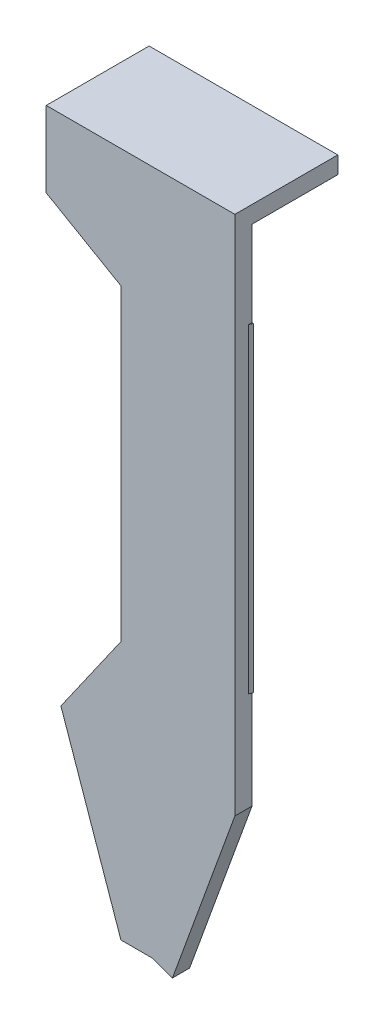
ISO-10303-21;
HEADER;
FILE_DESCRIPTION(('STEP AP214'),'2;1');
FILE_NAME('part.step','',(''),(''),'','','');
FILE_SCHEMA(('AUTOMOTIVE_DESIGN { 1 0 10303 214 1 1 1 1 }'));
ENDSEC;
DATA;
#1=APPLICATION_CONTEXT('core data for automotive mechanical design processes');
#2=APPLICATION_PROTOCOL_DEFINITION('international standard','automotive_design',2000,#1);
#3=PRODUCT_CONTEXT('',#1,'mechanical');
#4=PRODUCT('Part','Part','',(#3));
#5=PRODUCT_RELATED_PRODUCT_CATEGORY('part','',(#4));
#6=PRODUCT_DEFINITION_FORMATION('','',#4);
#7=PRODUCT_DEFINITION_CONTEXT('part definition',#1,'design');
#8=PRODUCT_DEFINITION('design','',#6,#7);
#9=PRODUCT_DEFINITION_SHAPE('','',#8);
#10=(LENGTH_UNIT() NAMED_UNIT(*) SI_UNIT(.MILLI.,.METRE.));
#11=(NAMED_UNIT(*) PLANE_ANGLE_UNIT() SI_UNIT($,.RADIAN.));
#12=(NAMED_UNIT(*) SI_UNIT($,.STERADIAN.) SOLID_ANGLE_UNIT());
#13=UNCERTAINTY_MEASURE_WITH_UNIT(LENGTH_MEASURE(1.E-05),#10,'distance_accuracy_value','');
#14=(GEOMETRIC_REPRESENTATION_CONTEXT(3) GLOBAL_UNCERTAINTY_ASSIGNED_CONTEXT((#13)) GLOBAL_UNIT_ASSIGNED_CONTEXT((#10,
#11,#12)) REPRESENTATION_CONTEXT('',''));
#15=CARTESIAN_POINT('',(0.,0.,0.));
#16=DIRECTION('',(0.,0.,1.));
#17=DIRECTION('',(1.,0.,0.));
#18=AXIS2_PLACEMENT_3D('',#15,#16,#17);
#19=CARTESIAN_POINT('',(73.289553246,-32.363508327,11.5));
#20=DIRECTION('',(0.,0.,1.));
#21=DIRECTION('',(1.,0.,0.));
#22=AXIS2_PLACEMENT_3D('',#19,#20,#21);
#23=PLANE('',#22);
#24=DIRECTION('',(-1.,0.,0.));
#25=VECTOR('',#24,1.);
#26=CARTESIAN_POINT('',(84.289553246,-32.363508327,11.5));
#27=LINE('',#26,#25);
#28=CARTESIAN_POINT('',(95.289553246,-32.3635083309895,11.5));
#29=VERTEX_POINT('',#28);
#30=CARTESIAN_POINT('',(73.289553246,-32.363508327,11.5));
#31=VERTEX_POINT('',#30);
#32=EDGE_CURVE('E154',#29,#31,#27,.T.);
#33=ORIENTED_EDGE('',*,*,#32,.T.);
#34=DIRECTION('',(0.,1.,0.));
#35=VECTOR('',#34,1.);
#36=CARTESIAN_POINT('',(73.289553246,-34.2040161205,11.5));
#37=LINE('',#36,#35);
#38=CARTESIAN_POINT('',(73.289553246,-30.363508327,11.5));
#39=VERTEX_POINT('',#38);
#40=EDGE_CURVE('E148',#31,#39,#37,.T.);
#41=ORIENTED_EDGE('',*,*,#40,.T.);
#42=DIRECTION('',(-1.,0.,0.));
#43=VECTOR('',#42,1.);
#44=CARTESIAN_POINT('',(84.289553246,-30.363508327,11.5));
#45=LINE('',#44,#43);
#46=CARTESIAN_POINT('',(95.289553246,-30.363508327,11.5));
#47=VERTEX_POINT('',#46);
#48=EDGE_CURVE('E446',#47,#39,#45,.T.);
#49=ORIENTED_EDGE('',*,*,#48,.F.);
#50=DIRECTION('',(0.,-1.,0.));
#51=VECTOR('',#50,1.);
#52=CARTESIAN_POINT('',(95.289553246,-60.748418779,11.5));
#53=LINE('',#52,#51);
#54=EDGE_CURVE('E603',#47,#29,#53,.T.);
#55=ORIENTED_EDGE('',*,*,#54,.T.);
#56=EDGE_LOOP('',(#33,#41,#49,#55));
#57=FACE_BOUND('',#56,.T.);
#58=ADVANCED_FACE('F19',(#57),#23,.F.);
#59=CARTESIAN_POINT('',(73.289553246,-30.363508327,11.5));
#60=DIRECTION('',(0.,1.,0.));
#61=DIRECTION('',(0.,0.,1.));
#62=AXIS2_PLACEMENT_3D('',#59,#60,#61);
#63=PLANE('',#62);
#64=DIRECTION('',(0.,0.,-1.));
#65=VECTOR('',#64,1.);
#66=CARTESIAN_POINT('',(95.289553246,-30.363508327,17.5));
#67=LINE('',#66,#65);
#68=CARTESIAN_POINT('',(95.289553246,-30.363508327,23.5));
#69=VERTEX_POINT('',#68);
#70=EDGE_CURVE('E250',#69,#47,#67,.T.);
#71=ORIENTED_EDGE('',*,*,#70,.T.);
#72=ORIENTED_EDGE('',*,*,#48,.T.);
#73=DIRECTION('',(0.,0.,1.));
#74=VECTOR('',#73,1.);
#75=CARTESIAN_POINT('',(73.289553246,-30.363508327,17.5));
#76=LINE('',#75,#74);
#77=CARTESIAN_POINT('',(73.289553246,-30.363508327,23.5));
#78=VERTEX_POINT('',#77);
#79=EDGE_CURVE('E177',#39,#78,#76,.T.);
#80=ORIENTED_EDGE('',*,*,#79,.T.);
#81=DIRECTION('',(1.,0.,0.));
#82=VECTOR('',#81,1.);
#83=CARTESIAN_POINT('',(84.289553246,-30.363508327,23.5));
#84=LINE('',#83,#82);
#85=EDGE_CURVE('E153',#78,#69,#84,.T.);
#86=ORIENTED_EDGE('',*,*,#85,.T.);
#87=EDGE_LOOP('',(#71,#72,#80,#86));
#88=FACE_BOUND('',#87,.T.);
#89=ADVANCED_FACE('F668',(#88),#63,.T.);
#90=CARTESIAN_POINT('',(73.289553246,-38.044523914,23.5));
#91=DIRECTION('',(1.,0.,0.));
#92=DIRECTION('',(0.,0.,-1.));
#93=AXIS2_PLACEMENT_3D('',#90,#91,#92);
#94=PLANE('',#93);
#95=ORIENTED_EDGE('',*,*,#40,.F.);
#96=DIRECTION('',(0.,0.,1.));
#97=VECTOR('',#96,1.);
#98=CARTESIAN_POINT('',(73.289553246,-32.363508327,16.5));
#99=LINE('',#98,#97);
#100=CARTESIAN_POINT('',(73.289553246,-32.363508327,21.5));
#101=VERTEX_POINT('',#100);
#102=EDGE_CURVE('E144',#31,#101,#99,.T.);
#103=ORIENTED_EDGE('',*,*,#102,.T.);
#104=DIRECTION('',(0.,-1.,0.));
#105=VECTOR('',#104,1.);
#106=CARTESIAN_POINT('',(73.289553246,-71.984728242,21.5));
#107=LINE('',#106,#105);
#108=CARTESIAN_POINT('',(73.289553246,-39.1992244517813,21.5));
#109=VERTEX_POINT('',#108);
#110=EDGE_CURVE('E129',#101,#109,#107,.T.);
#111=ORIENTED_EDGE('',*,*,#110,.T.);
#112=DIRECTION('',(0.,0.,1.));
#113=VECTOR('',#112,1.);
#114=CARTESIAN_POINT('',(73.289553246,-39.1992244517813,23.5));
#115=LINE('',#114,#113);
#116=CARTESIAN_POINT('',(73.289553246,-39.1992244517813,23.5));
#117=VERTEX_POINT('',#116);
#118=EDGE_CURVE('E160',#117,#109,#115,.F.);
#119=ORIENTED_EDGE('',*,*,#118,.F.);
#120=DIRECTION('',(0.,1.,0.));
#121=VECTOR('',#120,1.);
#122=CARTESIAN_POINT('',(73.289553246,-70.990728242,23.5));
#123=LINE('',#122,#121);
#124=EDGE_CURVE('E141',#117,#78,#123,.T.);
#125=ORIENTED_EDGE('',*,*,#124,.T.);
#126=ORIENTED_EDGE('',*,*,#79,.F.);
#127=EDGE_LOOP('',(#95,#103,#111,#119,#125,#126));
#128=FACE_BOUND('',#127,.T.);
#129=ADVANCED_FACE('F145',(#128),#94,.F.);
#130=CARTESIAN_POINT('',(74.289553246,-39.776574721,23.5));
#131=DIRECTION('',(0.500000000018918,0.866025403773516,0.));
#132=DIRECTION('',(0.866025403773516,-0.500000000018918,0.));
#133=AXIS2_PLACEMENT_3D('',#130,#131,#132);
#134=PLANE('',#133);
#135=DIRECTION('',(0.866025403773516,-0.500000000018918,0.));
#136=VECTOR('',#135,1.);
#137=CARTESIAN_POINT('',(74.289553246,-39.776574721,23.5));
#138=LINE('',#137,#136);
#139=CARTESIAN_POINT('',(82.,-44.2282032302188,23.5));
#140=VERTEX_POINT('',#139);
#141=EDGE_CURVE('E522',#140,#117,#138,.F.);
#142=ORIENTED_EDGE('',*,*,#141,.T.);
#143=ORIENTED_EDGE('',*,*,#118,.T.);
#144=DIRECTION('',(0.866025403773516,-0.500000000018918,0.));
#145=VECTOR('',#144,1.);
#146=CARTESIAN_POINT('',(74.289553246,-39.776574721,21.5));
#147=LINE('',#146,#145);
#148=CARTESIAN_POINT('',(82.,-44.2282032302188,21.5));
#149=VERTEX_POINT('',#148);
#150=EDGE_CURVE('E136',#109,#149,#147,.T.);
#151=ORIENTED_EDGE('',*,*,#150,.T.);
#152=DIRECTION('',(0.,0.,-1.));
#153=VECTOR('',#152,1.);
#154=CARTESIAN_POINT('',(82.,-44.2282032302188,23.5));
#155=LINE('',#154,#153);
#156=EDGE_CURVE('E168',#140,#149,#155,.T.);
#157=ORIENTED_EDGE('',*,*,#156,.F.);
#158=EDGE_LOOP('',(#142,#143,#151,#157));
#159=FACE_BOUND('',#158,.T.);
#160=ADVANCED_FACE('F692',(#159),#134,.F.);
#161=CARTESIAN_POINT('',(82.,-45.382903769,23.5));
#162=DIRECTION('',(1.,0.,0.));
#163=DIRECTION('',(0.,-1.,0.));
#164=AXIS2_PLACEMENT_3D('',#161,#162,#163);
#165=PLANE('',#164);
#166=DIRECTION('',(0.,1.,0.));
#167=VECTOR('',#166,1.);
#168=CARTESIAN_POINT('',(82.000000002,-70.990728242,23.5));
#169=LINE('',#168,#167);
#170=CARTESIAN_POINT('',(82.,-80.1622239197123,23.5));
#171=VERTEX_POINT('',#170);
#172=EDGE_CURVE('E216',#171,#140,#169,.T.);
#173=ORIENTED_EDGE('',*,*,#172,.T.);
#174=ORIENTED_EDGE('',*,*,#156,.T.);
#175=DIRECTION('',(0.,-1.,0.));
#176=VECTOR('',#175,1.);
#177=CARTESIAN_POINT('',(82.0000000060648,-71.984728242,21.5));
#178=LINE('',#177,#176);
#179=CARTESIAN_POINT('',(82.,-80.1622239197123,21.5));
#180=VERTEX_POINT('',#179);
#181=EDGE_CURVE('E366',#149,#180,#178,.T.);
#182=ORIENTED_EDGE('',*,*,#181,.T.);
#183=DIRECTION('',(0.,0.,-1.));
#184=VECTOR('',#183,1.);
#185=CARTESIAN_POINT('',(82.,-80.1622239197123,23.5));
#186=LINE('',#185,#184);
#187=EDGE_CURVE('E862',#171,#180,#186,.T.);
#188=ORIENTED_EDGE('',*,*,#187,.F.);
#189=EDGE_LOOP('',(#173,#174,#182,#188));
#190=FACE_BOUND('',#189,.T.);
#191=ADVANCED_FACE('F703',(#190),#165,.F.);
#192=CARTESIAN_POINT('',(81.638304089,-80.678779214,23.5));
#193=DIRECTION('',(0.819152044260943,-0.573576436391104,0.));
#194=DIRECTION('',(-0.573576436391104,-0.819152044260943,0.));
#195=AXIS2_PLACEMENT_3D('',#192,#193,#194);
#196=PLANE('',#195);
#197=DIRECTION('',(-0.573576436391104,-0.819152044260943,0.));
#198=VECTOR('',#197,1.);
#199=CARTESIAN_POINT('',(81.638304089,-80.678779214,21.5));
#200=LINE('',#199,#198);
#201=CARTESIAN_POINT('',(74.9999999998163,-90.1592599661289,21.5));
#202=VERTEX_POINT('',#201);
#203=EDGE_CURVE('E362',#180,#202,#200,.T.);
#204=ORIENTED_EDGE('',*,*,#203,.T.);
#205=DIRECTION('',(0.,0.,1.));
#206=VECTOR('',#205,1.);
#207=CARTESIAN_POINT('',(74.9999999998163,-90.1592599661289,23.5));
#208=LINE('',#207,#206);
#209=CARTESIAN_POINT('',(74.9999999998163,-90.1592599661289,23.5));
#210=VERTEX_POINT('',#209);
#211=EDGE_CURVE('E28',#210,#202,#208,.F.);
#212=ORIENTED_EDGE('',*,*,#211,.F.);
#213=DIRECTION('',(-0.573576436391104,-0.819152044260943,0.));
#214=VECTOR('',#213,1.);
#215=CARTESIAN_POINT('',(81.638304089,-80.678779214,23.5));
#216=LINE('',#215,#214);
#217=EDGE_CURVE('E534',#210,#171,#216,.F.);
#218=ORIENTED_EDGE('',*,*,#217,.T.);
#219=ORIENTED_EDGE('',*,*,#187,.T.);
#220=EDGE_LOOP('',(#204,#212,#218,#219));
#221=FACE_BOUND('',#220,.T.);
#222=ADVANCED_FACE('F715',(#221),#196,.F.);
#223=CARTESIAN_POINT('',(75.251803773,-90.883762014,23.5));
#224=DIRECTION('',(0.944576438528157,0.328291565193902,0.));
#225=DIRECTION('',(0.328291565193902,-0.944576438528157,0.));
#226=AXIS2_PLACEMENT_3D('',#223,#224,#225);
#227=PLANE('',#226);
#228=DIRECTION('',(0.328291565193902,-0.944576438528157,0.));
#229=VECTOR('',#228,1.);
#230=CARTESIAN_POINT('',(75.251803773,-90.883762014,21.5));
#231=LINE('',#230,#229);
#232=CARTESIAN_POINT('',(82.0000000000132,-110.3,21.5));
#233=VERTEX_POINT('',#232);
#234=EDGE_CURVE('E35',#202,#233,#231,.T.);
#235=ORIENTED_EDGE('',*,*,#234,.T.);
#236=DIRECTION('',(0.,0.,-1.));
#237=VECTOR('',#236,1.);
#238=CARTESIAN_POINT('',(82.0000000000132,-110.3,23.5));
#239=LINE('',#238,#237);
#240=CARTESIAN_POINT('',(82.0000000000132,-110.3,23.5));
#241=VERTEX_POINT('',#240);
#242=EDGE_CURVE('E12',#241,#233,#239,.T.);
#243=ORIENTED_EDGE('',*,*,#242,.F.);
#244=DIRECTION('',(0.328291565193902,-0.944576438528157,0.));
#245=VECTOR('',#244,1.);
#246=CARTESIAN_POINT('',(75.251803773,-90.883762014,23.5));
#247=LINE('',#246,#245);
#248=EDGE_CURVE('E325',#241,#210,#247,.F.);
#249=ORIENTED_EDGE('',*,*,#248,.T.);
#250=ORIENTED_EDGE('',*,*,#211,.T.);
#251=EDGE_LOOP('',(#235,#243,#249,#250));
#252=FACE_BOUND('',#251,.T.);
#253=ADVANCED_FACE('F727',(#252),#227,.F.);
#254=CARTESIAN_POINT('',(85.720595315,-110.3,23.5));
#255=DIRECTION('',(0.,-1.,0.));
#256=DIRECTION('',(-1.,0.,0.));
#257=AXIS2_PLACEMENT_3D('',#254,#255,#256);
#258=PLANE('',#257);
#259=DIRECTION('',(-1.,0.,0.));
#260=VECTOR('',#259,1.);
#261=CARTESIAN_POINT('',(84.289553246,-110.300000005395,23.5));
#262=LINE('',#261,#260);
#263=CARTESIAN_POINT('',(85.7205953224116,-110.300000002698,23.5));
#264=VERTEX_POINT('',#263);
#265=EDGE_CURVE('E42',#264,#241,#262,.T.);
#266=ORIENTED_EDGE('',*,*,#265,.T.);
#267=ORIENTED_EDGE('',*,*,#242,.T.);
#268=DIRECTION('',(1.,0.,0.));
#269=VECTOR('',#268,1.);
#270=CARTESIAN_POINT('',(84.3630224595,-110.300000021474,21.5));
#271=LINE('',#270,#269);
#272=CARTESIAN_POINT('',(85.7205953444996,-110.300000010737,21.5));
#273=VERTEX_POINT('',#272);
#274=EDGE_CURVE('E382',#233,#273,#271,.T.);
#275=ORIENTED_EDGE('',*,*,#274,.T.);
#276=DIRECTION('',(0.,0.,-1.));
#277=VECTOR('',#276,1.);
#278=CARTESIAN_POINT('',(85.720595315,-110.3,22.5));
#279=LINE('',#278,#277);
#280=EDGE_CURVE('E181',#264,#273,#279,.T.);
#281=ORIENTED_EDGE('',*,*,#280,.F.);
#282=EDGE_LOOP('',(#266,#267,#275,#281));
#283=FACE_BOUND('',#282,.T.);
#284=ADVANCED_FACE('F740',(#283),#258,.T.);
#285=CARTESIAN_POINT('',(88.01014856,-111.133329231,23.5));
#286=DIRECTION('',(-0.342020143344667,-0.939692620778993,0.));
#287=DIRECTION('',(-0.939692620778993,0.342020143344667,0.));
#288=AXIS2_PLACEMENT_3D('',#285,#286,#287);
#289=PLANE('',#288);
#290=DIRECTION('',(-0.939692620778993,0.342020143344667,0.));
#291=VECTOR('',#290,1.);
#292=CARTESIAN_POINT('',(88.01014856,-111.133329231,23.5));
#293=LINE('',#292,#291);
#294=CARTESIAN_POINT('',(88.01014856,-111.133329231,23.5));
#295=VERTEX_POINT('',#294);
#296=EDGE_CURVE('E318',#295,#264,#293,.T.);
#297=ORIENTED_EDGE('',*,*,#296,.T.);
#298=ORIENTED_EDGE('',*,*,#280,.T.);
#299=DIRECTION('',(-0.939692620778993,0.342020143344667,0.));
#300=VECTOR('',#299,1.);
#301=CARTESIAN_POINT('',(88.01014856,-111.133329231,21.5));
#302=LINE('',#301,#300);
#303=CARTESIAN_POINT('',(88.01014856,-111.133329231,21.5));
#304=VERTEX_POINT('',#303);
#305=EDGE_CURVE('E476',#273,#304,#302,.F.);
#306=ORIENTED_EDGE('',*,*,#305,.T.);
#307=DIRECTION('',(0.,0.,-1.));
#308=VECTOR('',#307,1.);
#309=CARTESIAN_POINT('',(88.01014856,-111.133329231,22.5));
#310=LINE('',#309,#308);
#311=EDGE_CURVE('E632',#295,#304,#310,.T.);
#312=ORIENTED_EDGE('',*,*,#311,.F.);
#313=EDGE_LOOP('',(#297,#298,#306,#312));
#314=FACE_BOUND('',#313,.T.);
#315=ADVANCED_FACE('F753',(#314),#289,.T.);
#316=CARTESIAN_POINT('',(88.01014856,-111.133329231,21.5));
#317=DIRECTION('',(0.939692620775701,-0.342020143353713,0.));
#318=DIRECTION('',(0.342020143353713,0.939692620775701,0.));
#319=AXIS2_PLACEMENT_3D('',#316,#317,#318);
#320=PLANE('',#319);
#321=DIRECTION('',(0.342020143353713,0.939692620775701,0.));
#322=VECTOR('',#321,1.);
#323=CARTESIAN_POINT('',(88.01014856,-111.133329231,23.5));
#324=LINE('',#323,#322);
#325=CARTESIAN_POINT('',(95.289553246,-91.133329231,23.5));
#326=VERTEX_POINT('',#325);
#327=EDGE_CURVE('E324',#326,#295,#324,.F.);
#328=ORIENTED_EDGE('',*,*,#327,.T.);
#329=ORIENTED_EDGE('',*,*,#311,.T.);
#330=DIRECTION('',(0.342020143353713,0.939692620775701,0.));
#331=VECTOR('',#330,1.);
#332=CARTESIAN_POINT('',(88.01014856,-111.133329231,21.5));
#333=LINE('',#332,#331);
#334=CARTESIAN_POINT('',(95.2895532468684,-91.1333292286142,21.5));
#335=VERTEX_POINT('',#334);
#336=EDGE_CURVE('E464',#304,#335,#333,.T.);
#337=ORIENTED_EDGE('',*,*,#336,.T.);
#338=DIRECTION('',(0.,0.,1.));
#339=VECTOR('',#338,1.);
#340=CARTESIAN_POINT('',(95.289553246,-91.133329231,17.5));
#341=LINE('',#340,#339);
#342=EDGE_CURVE('E305',#335,#326,#341,.T.);
#343=ORIENTED_EDGE('',*,*,#342,.T.);
#344=EDGE_LOOP('',(#328,#329,#337,#343));
#345=FACE_BOUND('',#344,.T.);
#346=ADVANCED_FACE('F765',(#345),#320,.T.);
#347=CARTESIAN_POINT('',(95.437373304,-79.599792462,21.895386265));
#348=DIRECTION('',(0.,1.,0.));
#349=DIRECTION('',(0.,0.,-1.));
#350=AXIS2_PLACEMENT_3D('',#347,#348,#349);
#351=PLANE('',#350);
#352=DIRECTION('',(1.,0.,0.));
#353=VECTOR('',#352,1.);
#354=CARTESIAN_POINT('',(84.3630224595,-79.5997924729699,21.5));
#355=LINE('',#354,#353);
#356=CARTESIAN_POINT('',(95.2895532471578,-79.5997924703335,21.4999999986667));
#357=VERTEX_POINT('',#356);
#358=CARTESIAN_POINT('',(95.4364916730518,-79.599792467485,21.5));
#359=VERTEX_POINT('',#358);
#360=EDGE_CURVE('E429',#357,#359,#355,.T.);
#361=ORIENTED_EDGE('',*,*,#360,.T.);
#362=CARTESIAN_POINT('',(93.5,-79.599792462,20.9999999999999));
#363=DIRECTION('',(0.,-1.,0.));
#364=DIRECTION('',(0.,0.,-1.));
#365=AXIS2_PLACEMENT_3D('',#362,#363,#364);
#366=CIRCLE('',#365,2.);
#367=CARTESIAN_POINT('',(95.289553246,-79.5997924662727,21.8930280978559));
#368=VERTEX_POINT('',#367);
#369=EDGE_CURVE('E626',#359,#368,#366,.T.);
#370=ORIENTED_EDGE('',*,*,#369,.T.);
#371=DIRECTION('',(0.,0.,-1.));
#372=VECTOR('',#371,1.);
#373=CARTESIAN_POINT('',(95.289553246,-79.5997924705455,17.5));
#374=LINE('',#373,#372);
#375=EDGE_CURVE('E303',#368,#357,#374,.T.);
#376=ORIENTED_EDGE('',*,*,#375,.T.);
#377=EDGE_LOOP('',(#361,#370,#376));
#378=FACE_BOUND('',#377,.T.);
#379=ADVANCED_FACE('F775',(#378),#351,.F.);
#380=CARTESIAN_POINT('',(93.5,-42.3,21.));
#381=DIRECTION('',(0.,-1.,0.));
#382=DIRECTION('',(0.,0.,-1.));
#383=AXIS2_PLACEMENT_3D('',#380,#381,#382);
#384=CYLINDRICAL_SURFACE('',#383,2.);
#385=DIRECTION('',(0.,-1.,0.));
#386=VECTOR('',#385,1.);
#387=CARTESIAN_POINT('',(95.289553246,-60.748418779,21.8930281));
#388=LINE('',#387,#386);
#389=CARTESIAN_POINT('',(95.289553246,-42.2999999929639,21.893028097856));
#390=VERTEX_POINT('',#389);
#391=EDGE_CURVE('E438',#390,#368,#388,.T.);
#392=ORIENTED_EDGE('',*,*,#391,.T.);
#393=ORIENTED_EDGE('',*,*,#369,.F.);
#394=DIRECTION('',(0.,1.,0.));
#395=VECTOR('',#394,1.);
#396=CARTESIAN_POINT('',(95.436491673,-71.984728242,21.5));
#397=LINE('',#396,#395);
#398=CARTESIAN_POINT('',(95.4364916730518,-42.300000019806,21.5));
#399=VERTEX_POINT('',#398);
#400=EDGE_CURVE('E346',#359,#399,#397,.T.);
#401=ORIENTED_EDGE('',*,*,#400,.T.);
#402=CARTESIAN_POINT('',(93.5,-42.3,21.));
#403=DIRECTION('',(0.,-1.,0.));
#404=DIRECTION('',(0.,0.,-1.));
#405=AXIS2_PLACEMENT_3D('',#402,#403,#404);
#406=CIRCLE('',#405,2.);
#407=EDGE_CURVE('E620',#390,#399,#406,.F.);
#408=ORIENTED_EDGE('',*,*,#407,.F.);
#409=EDGE_LOOP('',(#392,#393,#401,#408));
#410=FACE_BOUND('',#409,.T.);
#411=ADVANCED_FACE('F786',(#410),#384,.T.);
#412=CARTESIAN_POINT('',(95.437373304,-42.3,21.895386265));
#413=DIRECTION('',(0.,1.,0.));
#414=DIRECTION('',(0.,0.,-1.));
#415=AXIS2_PLACEMENT_3D('',#412,#413,#414);
#416=PLANE('',#415);
#417=DIRECTION('',(0.,0.,1.));
#418=VECTOR('',#417,1.);
#419=CARTESIAN_POINT('',(95.289553246,-42.2999999859278,17.5));
#420=LINE('',#419,#418);
#421=CARTESIAN_POINT('',(95.2895532468684,-42.3000000151152,21.5));
#422=VERTEX_POINT('',#421);
#423=EDGE_CURVE('E275',#422,#390,#420,.T.);
#424=ORIENTED_EDGE('',*,*,#423,.T.);
#425=ORIENTED_EDGE('',*,*,#407,.T.);
#426=DIRECTION('',(-1.,0.,0.));
#427=VECTOR('',#426,1.);
#428=CARTESIAN_POINT('',(84.3630224595,-42.3000000396119,21.5));
#429=LINE('',#428,#427);
#430=EDGE_CURVE('E170',#399,#422,#429,.T.);
#431=ORIENTED_EDGE('',*,*,#430,.T.);
#432=EDGE_LOOP('',(#424,#425,#431));
#433=FACE_BOUND('',#432,.T.);
#434=ADVANCED_FACE('F798',(#433),#416,.T.);
#435=CARTESIAN_POINT('',(95.289553246,-91.133329231,11.5));
#436=DIRECTION('',(-1.,0.,0.));
#437=DIRECTION('',(0.,0.,1.));
#438=AXIS2_PLACEMENT_3D('',#435,#436,#437);
#439=PLANE('',#438);
#440=ORIENTED_EDGE('',*,*,#375,.F.);
#441=ORIENTED_EDGE('',*,*,#391,.F.);
#442=ORIENTED_EDGE('',*,*,#423,.F.);
#443=DIRECTION('',(0.,1.,0.));
#444=VECTOR('',#443,1.);
#445=CARTESIAN_POINT('',(95.2895532477368,-71.984728242,21.5));
#446=LINE('',#445,#444);
#447=CARTESIAN_POINT('',(95.2895532467237,-32.3635083289947,21.4999999993333));
#448=VERTEX_POINT('',#447);
#449=EDGE_CURVE('E161',#422,#448,#446,.T.);
#450=ORIENTED_EDGE('',*,*,#449,.T.);
#451=DIRECTION('',(0.,0.,-1.));
#452=VECTOR('',#451,1.);
#453=CARTESIAN_POINT('',(95.289553246,-32.363508327,16.5));
#454=LINE('',#453,#452);
#455=EDGE_CURVE('E158',#448,#29,#454,.T.);
#456=ORIENTED_EDGE('',*,*,#455,.T.);
#457=ORIENTED_EDGE('',*,*,#54,.F.);
#458=ORIENTED_EDGE('',*,*,#70,.F.);
#459=DIRECTION('',(0.,-1.,0.));
#460=VECTOR('',#459,1.);
#461=CARTESIAN_POINT('',(95.289553246,-70.990728242,23.5));
#462=LINE('',#461,#460);
#463=EDGE_CURVE('E559',#69,#326,#462,.T.);
#464=ORIENTED_EDGE('',*,*,#463,.T.);
#465=ORIENTED_EDGE('',*,*,#342,.F.);
#466=DIRECTION('',(0.,1.,0.));
#467=VECTOR('',#466,1.);
#468=CARTESIAN_POINT('',(95.2895532477368,-71.984728242,21.5));
#469=LINE('',#468,#467);
#470=EDGE_CURVE('E456',#335,#357,#469,.T.);
#471=ORIENTED_EDGE('',*,*,#470,.T.);
#472=EDGE_LOOP('',(#440,#441,#442,#450,#456,#457,#458,#464,#465,#471));
#473=FACE_BOUND('',#472,.T.);
#474=ADVANCED_FACE('F810',(#473),#439,.F.);
#475=CARTESIAN_POINT('',(73.289553246,-32.363508327,11.5));
#476=DIRECTION('',(0.,1.,0.));
#477=DIRECTION('',(0.,0.,1.));
#478=AXIS2_PLACEMENT_3D('',#475,#476,#477);
#479=PLANE('',#478);
#480=ORIENTED_EDGE('',*,*,#102,.F.);
#481=ORIENTED_EDGE('',*,*,#32,.F.);
#482=ORIENTED_EDGE('',*,*,#455,.F.);
#483=DIRECTION('',(-1.,0.,0.));
#484=VECTOR('',#483,1.);
#485=CARTESIAN_POINT('',(84.3630224595,-32.363508327,21.5));
#486=LINE('',#485,#484);
#487=EDGE_CURVE('E133',#448,#101,#486,.T.);
#488=ORIENTED_EDGE('',*,*,#487,.T.);
#489=EDGE_LOOP('',(#480,#481,#482,#488));
#490=FACE_BOUND('',#489,.T.);
#491=ADVANCED_FACE('F156',(#490),#479,.F.);
#492=CARTESIAN_POINT('',(95.289553246,-111.617948157,23.5));
#493=DIRECTION('',(0.,0.,-1.));
#494=DIRECTION('',(-1.,0.,0.));
#495=AXIS2_PLACEMENT_3D('',#492,#493,#494);
#496=PLANE('',#495);
#497=ORIENTED_EDGE('',*,*,#124,.F.);
#498=ORIENTED_EDGE('',*,*,#141,.F.);
#499=ORIENTED_EDGE('',*,*,#172,.F.);
#500=ORIENTED_EDGE('',*,*,#217,.F.);
#501=ORIENTED_EDGE('',*,*,#248,.F.);
#502=ORIENTED_EDGE('',*,*,#265,.F.);
#503=ORIENTED_EDGE('',*,*,#296,.F.);
#504=ORIENTED_EDGE('',*,*,#327,.F.);
#505=ORIENTED_EDGE('',*,*,#463,.F.);
#506=ORIENTED_EDGE('',*,*,#85,.F.);
#507=EDGE_LOOP('',(#497,#498,#499,#500,#501,#502,#503,#504,#505,#506));
#508=FACE_BOUND('',#507,.T.);
#509=ADVANCED_FACE('F832',(#508),#496,.F.);
#510=CARTESIAN_POINT('',(73.289553246,-32.363508327,21.5));
#511=DIRECTION('',(0.,0.,1.));
#512=DIRECTION('',(0.,-1.,0.));
#513=AXIS2_PLACEMENT_3D('',#510,#511,#512);
#514=PLANE('',#513);
#515=ORIENTED_EDGE('',*,*,#449,.F.);
#516=ORIENTED_EDGE('',*,*,#430,.F.);
#517=ORIENTED_EDGE('',*,*,#400,.F.);
#518=ORIENTED_EDGE('',*,*,#360,.F.);
#519=ORIENTED_EDGE('',*,*,#470,.F.);
#520=ORIENTED_EDGE('',*,*,#336,.F.);
#521=ORIENTED_EDGE('',*,*,#305,.F.);
#522=ORIENTED_EDGE('',*,*,#274,.F.);
#523=ORIENTED_EDGE('',*,*,#234,.F.);
#524=ORIENTED_EDGE('',*,*,#203,.F.);
#525=ORIENTED_EDGE('',*,*,#181,.F.);
#526=ORIENTED_EDGE('',*,*,#150,.F.);
#527=ORIENTED_EDGE('',*,*,#110,.F.);
#528=ORIENTED_EDGE('',*,*,#487,.F.);
#529=EDGE_LOOP('',(#515,#516,#517,#518,#519,#520,#521,#522,#523,#524,#525,#526,#527,#528));
#530=FACE_BOUND('',#529,.T.);
#531=ADVANCED_FACE('F21',(#530),#514,.F.);
#532=CLOSED_SHELL('',(#58,#89,#129,#160,#191,#222,#253,#284,#315,#346,#379,#411,#434,#474,#491,
#509,#531));
#533=MANIFOLD_SOLID_BREP('B1',#532);
#534=ADVANCED_BREP_SHAPE_REPRESENTATION('',(#18,#533),#14);
#535=SHAPE_DEFINITION_REPRESENTATION(#9,#534);
ENDSEC;
END-ISO-10303-21;
